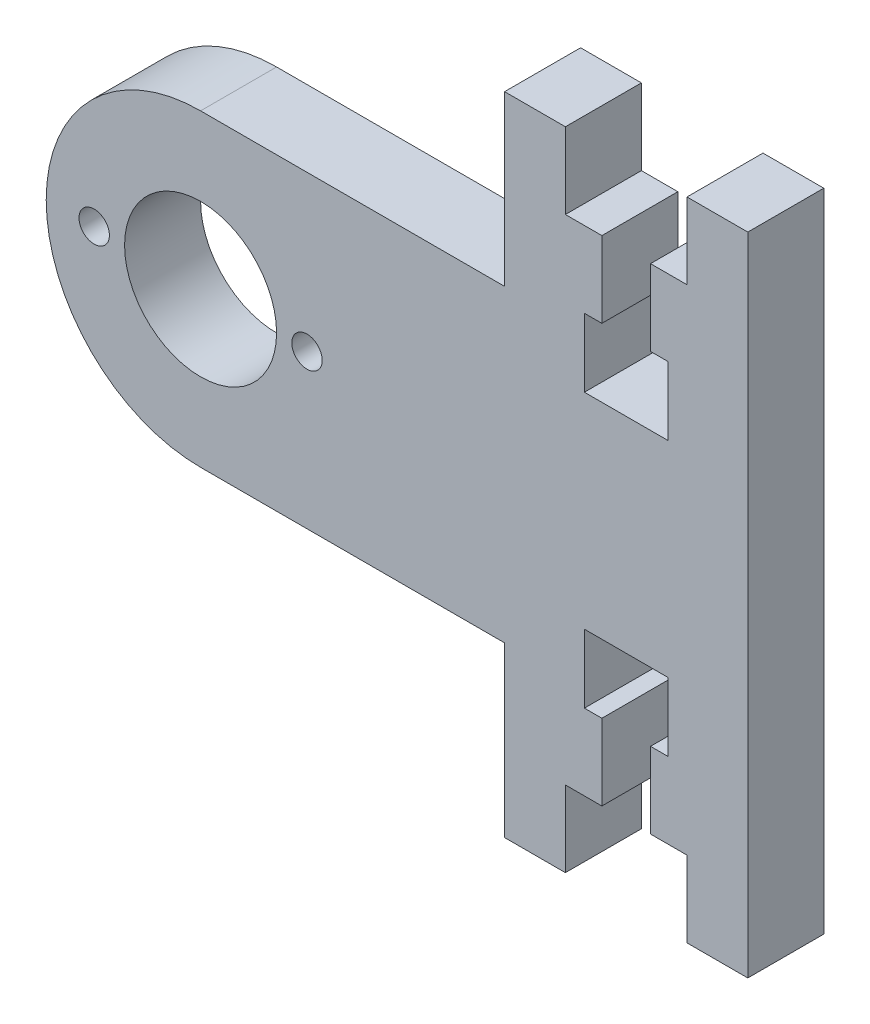
ISO-10303-21;
HEADER;
FILE_DESCRIPTION(('STEP AP214'),'2;1');
FILE_NAME('part.step','',(''),(''),'','','');
FILE_SCHEMA(('AUTOMOTIVE_DESIGN { 1 0 10303 214 1 1 1 1 }'));
ENDSEC;
DATA;
#1=APPLICATION_CONTEXT('core data for automotive mechanical design processes');
#2=APPLICATION_PROTOCOL_DEFINITION('international standard','automotive_design',2000,#1);
#3=PRODUCT_CONTEXT('',#1,'mechanical');
#4=PRODUCT('Part','Part','',(#3));
#5=PRODUCT_RELATED_PRODUCT_CATEGORY('part','',(#4));
#6=PRODUCT_DEFINITION_FORMATION('','',#4);
#7=PRODUCT_DEFINITION_CONTEXT('part definition',#1,'design');
#8=PRODUCT_DEFINITION('design','',#6,#7);
#9=PRODUCT_DEFINITION_SHAPE('','',#8);
#10=(LENGTH_UNIT() NAMED_UNIT(*) SI_UNIT(.MILLI.,.METRE.));
#11=(NAMED_UNIT(*) PLANE_ANGLE_UNIT() SI_UNIT($,.RADIAN.));
#12=(NAMED_UNIT(*) SI_UNIT($,.STERADIAN.) SOLID_ANGLE_UNIT());
#13=UNCERTAINTY_MEASURE_WITH_UNIT(LENGTH_MEASURE(1.E-05),#10,'distance_accuracy_value','');
#14=(GEOMETRIC_REPRESENTATION_CONTEXT(3) GLOBAL_UNCERTAINTY_ASSIGNED_CONTEXT((#13)) GLOBAL_UNIT_ASSIGNED_CONTEXT((#10,
#11,#12)) REPRESENTATION_CONTEXT('',''));
#15=CARTESIAN_POINT('',(0.,0.,0.));
#16=DIRECTION('',(0.,0.,1.));
#17=DIRECTION('',(1.,0.,0.));
#18=AXIS2_PLACEMENT_3D('',#15,#16,#17);
#19=CARTESIAN_POINT('',(0.,5.,5.));
#20=DIRECTION('',(0.,-1.,0.));
#21=DIRECTION('',(0.,0.,-1.));
#22=AXIS2_PLACEMENT_3D('',#19,#20,#21);
#23=PLANE('',#22);
#24=DIRECTION('',(0.,0.,1.));
#25=VECTOR('',#24,1.);
#26=CARTESIAN_POINT('',(-9.6,5.,-5.));
#27=LINE('',#26,#25);
#28=CARTESIAN_POINT('',(-9.6,5.,0.));
#29=VERTEX_POINT('',#28);
#30=CARTESIAN_POINT('',(-9.6,5.,5.));
#31=VERTEX_POINT('',#30);
#32=EDGE_CURVE('E323',#29,#31,#27,.T.);
#33=ORIENTED_EDGE('',*,*,#32,.T.);
#34=DIRECTION('',(-1.,0.,0.));
#35=VECTOR('',#34,1.);
#36=CARTESIAN_POINT('',(0.,5.,5.));
#37=LINE('',#36,#35);
#38=CARTESIAN_POINT('',(-12.,5.,5.));
#39=VERTEX_POINT('',#38);
#40=EDGE_CURVE('E396',#31,#39,#37,.T.);
#41=ORIENTED_EDGE('',*,*,#40,.T.);
#42=DIRECTION('',(0.,0.,1.));
#43=VECTOR('',#42,1.);
#44=CARTESIAN_POINT('',(-12.,5.,-5.));
#45=LINE('',#44,#43);
#46=CARTESIAN_POINT('',(-12.,5.,0.));
#47=VERTEX_POINT('',#46);
#48=EDGE_CURVE('E295',#47,#39,#45,.T.);
#49=ORIENTED_EDGE('',*,*,#48,.F.);
#50=DIRECTION('',(-1.,0.,0.));
#51=VECTOR('',#50,1.);
#52=CARTESIAN_POINT('',(0.,5.,0.));
#53=LINE('',#52,#51);
#54=EDGE_CURVE('E391',#29,#47,#53,.T.);
#55=ORIENTED_EDGE('',*,*,#54,.F.);
#56=EDGE_LOOP('',(#33,#41,#49,#55));
#57=FACE_BOUND('',#56,.T.);
#58=ADVANCED_FACE('F36',(#57),#23,.T.);
#59=CARTESIAN_POINT('',(-3.24547534604185E-13,37.5,5.));
#60=DIRECTION('',(0.,-1.,0.));
#61=DIRECTION('',(1.,0.,0.));
#62=AXIS2_PLACEMENT_3D('',#59,#60,#61);
#63=PLANE('',#62);
#64=DIRECTION('',(-1.,0.,0.));
#65=VECTOR('',#64,1.);
#66=CARTESIAN_POINT('',(-3.24547534604185E-13,37.5,5.));
#67=LINE('',#66,#65);
#68=CARTESIAN_POINT('',(-9.59999999999999,37.5,5.));
#69=VERTEX_POINT('',#68);
#70=CARTESIAN_POINT('',(-12.,37.5,5.));
#71=VERTEX_POINT('',#70);
#72=EDGE_CURVE('E260',#69,#71,#67,.T.);
#73=ORIENTED_EDGE('',*,*,#72,.F.);
#74=DIRECTION('',(0.,0.,1.));
#75=VECTOR('',#74,1.);
#76=CARTESIAN_POINT('',(-9.59999999999999,37.5,-5.));
#77=LINE('',#76,#75);
#78=CARTESIAN_POINT('',(-9.59999999999999,37.5,0.));
#79=VERTEX_POINT('',#78);
#80=EDGE_CURVE('E362',#79,#69,#77,.T.);
#81=ORIENTED_EDGE('',*,*,#80,.F.);
#82=DIRECTION('',(-1.,0.,0.));
#83=VECTOR('',#82,1.);
#84=CARTESIAN_POINT('',(-3.24547534604185E-13,37.5,0.));
#85=LINE('',#84,#83);
#86=CARTESIAN_POINT('',(-12.,37.5,0.));
#87=VERTEX_POINT('',#86);
#88=EDGE_CURVE('E59',#79,#87,#85,.T.);
#89=ORIENTED_EDGE('',*,*,#88,.T.);
#90=DIRECTION('',(0.,0.,1.));
#91=VECTOR('',#90,1.);
#92=CARTESIAN_POINT('',(-12.,37.5,-5.));
#93=LINE('',#92,#91);
#94=EDGE_CURVE('E284',#87,#71,#93,.T.);
#95=ORIENTED_EDGE('',*,*,#94,.T.);
#96=EDGE_LOOP('',(#73,#81,#89,#95));
#97=FACE_BOUND('',#96,.T.);
#98=ADVANCED_FACE('F531',(#97),#63,.F.);
#99=DIRECTION('',(0.,0.,1.));
#100=VECTOR('',#99,1.);
#101=CARTESIAN_POINT('',(-6.4,5.,-5.));
#102=LINE('',#101,#100);
#103=CARTESIAN_POINT('',(-6.4,5.,0.));
#104=VERTEX_POINT('',#103);
#105=CARTESIAN_POINT('',(-6.4,5.,5.));
#106=VERTEX_POINT('',#105);
#107=EDGE_CURVE('E337',#104,#106,#102,.T.);
#108=ORIENTED_EDGE('',*,*,#107,.F.);
#109=CARTESIAN_POINT('',(-4.,5.,0.));
#110=VERTEX_POINT('',#109);
#111=EDGE_CURVE('E51',#110,#104,#53,.T.);
#112=ORIENTED_EDGE('',*,*,#111,.F.);
#113=DIRECTION('',(0.,0.,1.));
#114=VECTOR('',#113,1.);
#115=CARTESIAN_POINT('',(-4.,5.,-5.));
#116=LINE('',#115,#114);
#117=CARTESIAN_POINT('',(-4.,5.,5.));
#118=VERTEX_POINT('',#117);
#119=EDGE_CURVE('E285',#110,#118,#116,.T.);
#120=ORIENTED_EDGE('',*,*,#119,.T.);
#121=EDGE_CURVE('E392',#118,#106,#37,.T.);
#122=ORIENTED_EDGE('',*,*,#121,.T.);
#123=EDGE_LOOP('',(#108,#112,#120,#122));
#124=FACE_BOUND('',#123,.T.);
#125=ADVANCED_FACE('F38',(#124),#23,.T.);
#126=CARTESIAN_POINT('',(0.,0.,5.));
#127=DIRECTION('',(0.,1.,0.));
#128=DIRECTION('',(-1.,0.,0.));
#129=AXIS2_PLACEMENT_3D('',#126,#127,#128);
#130=PLANE('',#129);
#131=DIRECTION('',(1.,0.,0.));
#132=VECTOR('',#131,1.);
#133=CARTESIAN_POINT('',(0.,0.,5.));
#134=LINE('',#133,#132);
#135=CARTESIAN_POINT('',(-4.,0.,5.));
#136=VERTEX_POINT('',#135);
#137=CARTESIAN_POINT('',(0.,0.,5.));
#138=VERTEX_POINT('',#137);
#139=EDGE_CURVE('E395',#136,#138,#134,.T.);
#140=ORIENTED_EDGE('',*,*,#139,.F.);
#141=DIRECTION('',(0.,0.,1.));
#142=VECTOR('',#141,1.);
#143=CARTESIAN_POINT('',(-4.,0.,-5.));
#144=LINE('',#143,#142);
#145=CARTESIAN_POINT('',(-4.,0.,0.));
#146=VERTEX_POINT('',#145);
#147=EDGE_CURVE('E283',#146,#136,#144,.T.);
#148=ORIENTED_EDGE('',*,*,#147,.F.);
#149=DIRECTION('',(1.,0.,0.));
#150=VECTOR('',#149,1.);
#151=CARTESIAN_POINT('',(0.,0.,0.));
#152=LINE('',#151,#150);
#153=CARTESIAN_POINT('',(0.,0.,0.));
#154=VERTEX_POINT('',#153);
#155=EDGE_CURVE('E420',#146,#154,#152,.T.);
#156=ORIENTED_EDGE('',*,*,#155,.T.);
#157=DIRECTION('',(0.,0.,-1.));
#158=VECTOR('',#157,1.);
#159=CARTESIAN_POINT('',(0.,0.,5.));
#160=LINE('',#159,#158);
#161=EDGE_CURVE('E464',#138,#154,#160,.T.);
#162=ORIENTED_EDGE('',*,*,#161,.F.);
#163=EDGE_LOOP('',(#140,#148,#156,#162));
#164=FACE_BOUND('',#163,.T.);
#165=ADVANCED_FACE('F538',(#164),#130,.F.);
#166=CARTESIAN_POINT('',(0.,0.,5.));
#167=DIRECTION('',(-1.,0.,0.));
#168=DIRECTION('',(0.,0.,1.));
#169=AXIS2_PLACEMENT_3D('',#166,#167,#168);
#170=PLANE('',#169);
#171=DIRECTION('',(0.,1.,0.));
#172=VECTOR('',#171,1.);
#173=CARTESIAN_POINT('',(0.,0.,0.));
#174=LINE('',#173,#172);
#175=CARTESIAN_POINT('',(0.,42.5,0.));
#176=VERTEX_POINT('',#175);
#177=EDGE_CURVE('E422',#154,#176,#174,.T.);
#178=ORIENTED_EDGE('',*,*,#177,.T.);
#179=DIRECTION('',(0.,0.,-1.));
#180=VECTOR('',#179,1.);
#181=CARTESIAN_POINT('',(0.,42.5,5.));
#182=LINE('',#181,#180);
#183=CARTESIAN_POINT('',(0.,42.5,5.));
#184=VERTEX_POINT('',#183);
#185=EDGE_CURVE('E461',#184,#176,#182,.T.);
#186=ORIENTED_EDGE('',*,*,#185,.F.);
#187=DIRECTION('',(0.,1.,0.));
#188=VECTOR('',#187,1.);
#189=CARTESIAN_POINT('',(0.,0.,5.));
#190=LINE('',#189,#188);
#191=EDGE_CURVE('E398',#138,#184,#190,.T.);
#192=ORIENTED_EDGE('',*,*,#191,.F.);
#193=ORIENTED_EDGE('',*,*,#161,.T.);
#194=EDGE_LOOP('',(#178,#186,#192,#193));
#195=FACE_BOUND('',#194,.T.);
#196=ADVANCED_FACE('F549',(#195),#170,.F.);
#197=CARTESIAN_POINT('',(0.,42.5,5.));
#198=DIRECTION('',(0.,-1.,0.));
#199=DIRECTION('',(1.,0.,0.));
#200=AXIS2_PLACEMENT_3D('',#197,#198,#199);
#201=PLANE('',#200);
#202=DIRECTION('',(-1.,0.,0.));
#203=VECTOR('',#202,1.);
#204=CARTESIAN_POINT('',(0.,42.5,0.));
#205=LINE('',#204,#203);
#206=CARTESIAN_POINT('',(-4.,42.5,0.));
#207=VERTEX_POINT('',#206);
#208=EDGE_CURVE('E424',#176,#207,#205,.T.);
#209=ORIENTED_EDGE('',*,*,#208,.T.);
#210=DIRECTION('',(0.,0.,1.));
#211=VECTOR('',#210,1.);
#212=CARTESIAN_POINT('',(-4.,42.5,-5.));
#213=LINE('',#212,#211);
#214=CARTESIAN_POINT('',(-4.,42.5,5.));
#215=VERTEX_POINT('',#214);
#216=EDGE_CURVE('E269',#207,#215,#213,.T.);
#217=ORIENTED_EDGE('',*,*,#216,.T.);
#218=DIRECTION('',(-1.,0.,0.));
#219=VECTOR('',#218,1.);
#220=CARTESIAN_POINT('',(0.,42.5,5.));
#221=LINE('',#220,#219);
#222=EDGE_CURVE('E275',#184,#215,#221,.T.);
#223=ORIENTED_EDGE('',*,*,#222,.F.);
#224=ORIENTED_EDGE('',*,*,#185,.T.);
#225=EDGE_LOOP('',(#209,#217,#223,#224));
#226=FACE_BOUND('',#225,.T.);
#227=ADVANCED_FACE('F543',(#226),#201,.F.);
#228=CARTESIAN_POINT('',(-4.,37.5,0.));
#229=VERTEX_POINT('',#228);
#230=CARTESIAN_POINT('',(-6.39999999999999,37.5,0.));
#231=VERTEX_POINT('',#230);
#232=EDGE_CURVE('E427',#229,#231,#85,.T.);
#233=ORIENTED_EDGE('',*,*,#232,.T.);
#234=DIRECTION('',(0.,0.,1.));
#235=VECTOR('',#234,1.);
#236=CARTESIAN_POINT('',(-6.39999999999999,37.5,-5.));
#237=LINE('',#236,#235);
#238=CARTESIAN_POINT('',(-6.39999999999999,37.5,5.));
#239=VERTEX_POINT('',#238);
#240=EDGE_CURVE('E255',#231,#239,#237,.T.);
#241=ORIENTED_EDGE('',*,*,#240,.T.);
#242=CARTESIAN_POINT('',(-4.,37.5,5.));
#243=VERTEX_POINT('',#242);
#244=EDGE_CURVE('E250',#243,#239,#67,.T.);
#245=ORIENTED_EDGE('',*,*,#244,.F.);
#246=DIRECTION('',(0.,0.,1.));
#247=VECTOR('',#246,1.);
#248=CARTESIAN_POINT('',(-4.,37.5,-5.));
#249=LINE('',#248,#247);
#250=EDGE_CURVE('E254',#229,#243,#249,.T.);
#251=ORIENTED_EDGE('',*,*,#250,.F.);
#252=EDGE_LOOP('',(#233,#241,#245,#251));
#253=FACE_BOUND('',#252,.T.);
#254=ADVANCED_FACE('F253',(#253),#63,.F.);
#255=CARTESIAN_POINT('',(0.,42.5,5.));
#256=DIRECTION('',(0.,1.,0.));
#257=DIRECTION('',(0.,0.,1.));
#258=AXIS2_PLACEMENT_3D('',#255,#256,#257);
#259=PLANE('',#258);
#260=DIRECTION('',(0.,0.,1.));
#261=VECTOR('',#260,1.);
#262=CARTESIAN_POINT('',(-12.,42.5,-5.));
#263=LINE('',#262,#261);
#264=CARTESIAN_POINT('',(-12.,42.5,0.));
#265=VERTEX_POINT('',#264);
#266=CARTESIAN_POINT('',(-12.,42.5,5.));
#267=VERTEX_POINT('',#266);
#268=EDGE_CURVE('E291',#265,#267,#263,.T.);
#269=ORIENTED_EDGE('',*,*,#268,.F.);
#270=DIRECTION('',(1.,0.,0.));
#271=VECTOR('',#270,1.);
#272=CARTESIAN_POINT('',(0.,42.5,0.));
#273=LINE('',#272,#271);
#274=CARTESIAN_POINT('',(-16.,42.5,0.));
#275=VERTEX_POINT('',#274);
#276=EDGE_CURVE('E429',#275,#265,#273,.T.);
#277=ORIENTED_EDGE('',*,*,#276,.F.);
#278=DIRECTION('',(0.,0.,-1.));
#279=VECTOR('',#278,1.);
#280=CARTESIAN_POINT('',(-16.,42.5,5.));
#281=LINE('',#280,#279);
#282=CARTESIAN_POINT('',(-16.,42.5,5.));
#283=VERTEX_POINT('',#282);
#284=EDGE_CURVE('E459',#283,#275,#281,.T.);
#285=ORIENTED_EDGE('',*,*,#284,.F.);
#286=DIRECTION('',(1.,0.,0.));
#287=VECTOR('',#286,1.);
#288=CARTESIAN_POINT('',(0.,42.5,5.));
#289=LINE('',#288,#287);
#290=EDGE_CURVE('E259',#283,#267,#289,.T.);
#291=ORIENTED_EDGE('',*,*,#290,.T.);
#292=EDGE_LOOP('',(#269,#277,#285,#291));
#293=FACE_BOUND('',#292,.T.);
#294=ADVANCED_FACE('F523',(#293),#259,.T.);
#295=CARTESIAN_POINT('',(-16.,0.,5.));
#296=DIRECTION('',(1.,0.,0.));
#297=DIRECTION('',(0.,0.,-1.));
#298=AXIS2_PLACEMENT_3D('',#295,#296,#297);
#299=PLANE('',#298);
#300=DIRECTION('',(0.,-1.,0.));
#301=VECTOR('',#300,1.);
#302=CARTESIAN_POINT('',(-16.,0.,0.));
#303=LINE('',#302,#301);
#304=CARTESIAN_POINT('',(-16.,31.40625,0.));
#305=VERTEX_POINT('',#304);
#306=EDGE_CURVE('E432',#275,#305,#303,.T.);
#307=ORIENTED_EDGE('',*,*,#306,.T.);
#308=DIRECTION('',(0.,0.,-1.));
#309=VECTOR('',#308,1.);
#310=CARTESIAN_POINT('',(-16.,31.40625,5.));
#311=LINE('',#310,#309);
#312=CARTESIAN_POINT('',(-16.,31.40625,5.));
#313=VERTEX_POINT('',#312);
#314=EDGE_CURVE('E457',#313,#305,#311,.T.);
#315=ORIENTED_EDGE('',*,*,#314,.F.);
#316=DIRECTION('',(0.,-1.,0.));
#317=VECTOR('',#316,1.);
#318=CARTESIAN_POINT('',(-16.,0.,5.));
#319=LINE('',#318,#317);
#320=EDGE_CURVE('E403',#283,#313,#319,.T.);
#321=ORIENTED_EDGE('',*,*,#320,.F.);
#322=ORIENTED_EDGE('',*,*,#284,.T.);
#323=EDGE_LOOP('',(#307,#315,#321,#322));
#324=FACE_BOUND('',#323,.T.);
#325=ADVANCED_FACE('F548',(#324),#299,.F.);
#326=CARTESIAN_POINT('',(0.,31.40625,5.));
#327=DIRECTION('',(0.,1.,0.));
#328=DIRECTION('',(-1.,0.,0.));
#329=AXIS2_PLACEMENT_3D('',#326,#327,#328);
#330=PLANE('',#329);
#331=DIRECTION('',(1.,0.,0.));
#332=VECTOR('',#331,1.);
#333=CARTESIAN_POINT('',(0.,31.40625,0.));
#334=LINE('',#333,#332);
#335=CARTESIAN_POINT('',(-36.,31.40625,0.));
#336=VERTEX_POINT('',#335);
#337=EDGE_CURVE('E435',#336,#305,#334,.T.);
#338=ORIENTED_EDGE('',*,*,#337,.F.);
#339=DIRECTION('',(0.,0.,-1.));
#340=VECTOR('',#339,1.);
#341=CARTESIAN_POINT('',(-36.,31.40625,5.));
#342=LINE('',#341,#340);
#343=CARTESIAN_POINT('',(-36.,31.40625,5.));
#344=VERTEX_POINT('',#343);
#345=EDGE_CURVE('E455',#344,#336,#342,.T.);
#346=ORIENTED_EDGE('',*,*,#345,.F.);
#347=DIRECTION('',(1.,0.,0.));
#348=VECTOR('',#347,1.);
#349=CARTESIAN_POINT('',(0.,31.40625,5.));
#350=LINE('',#349,#348);
#351=EDGE_CURVE('E405',#344,#313,#350,.T.);
#352=ORIENTED_EDGE('',*,*,#351,.T.);
#353=ORIENTED_EDGE('',*,*,#314,.T.);
#354=EDGE_LOOP('',(#338,#346,#352,#353));
#355=FACE_BOUND('',#354,.T.);
#356=ADVANCED_FACE('F647',(#355),#330,.T.);
#357=CARTESIAN_POINT('',(-36.,21.25,5.));
#358=DIRECTION('',(0.,0.,-1.));
#359=DIRECTION('',(-1.,0.,0.));
#360=AXIS2_PLACEMENT_3D('',#357,#358,#359);
#361=CYLINDRICAL_SURFACE('',#360,10.15625);
#362=CARTESIAN_POINT('',(-36.,21.25,0.));
#363=DIRECTION('',(0.,0.,1.));
#364=DIRECTION('',(1.,0.,0.));
#365=AXIS2_PLACEMENT_3D('',#362,#363,#364);
#366=CIRCLE('',#365,10.15625);
#367=CARTESIAN_POINT('',(-36.,11.09375,0.));
#368=VERTEX_POINT('',#367);
#369=EDGE_CURVE('E438',#336,#368,#366,.T.);
#370=ORIENTED_EDGE('',*,*,#369,.T.);
#371=DIRECTION('',(0.,0.,-1.));
#372=VECTOR('',#371,1.);
#373=CARTESIAN_POINT('',(-36.,11.09375,5.));
#374=LINE('',#373,#372);
#375=CARTESIAN_POINT('',(-36.,11.09375,5.));
#376=VERTEX_POINT('',#375);
#377=EDGE_CURVE('E453',#376,#368,#374,.T.);
#378=ORIENTED_EDGE('',*,*,#377,.F.);
#379=CARTESIAN_POINT('',(-36.,21.25,5.));
#380=DIRECTION('',(0.,0.,1.));
#381=DIRECTION('',(1.,0.,0.));
#382=AXIS2_PLACEMENT_3D('',#379,#380,#381);
#383=CIRCLE('',#382,10.15625);
#384=EDGE_CURVE('E408',#344,#376,#383,.T.);
#385=ORIENTED_EDGE('',*,*,#384,.F.);
#386=ORIENTED_EDGE('',*,*,#345,.T.);
#387=EDGE_LOOP('',(#370,#378,#385,#386));
#388=FACE_BOUND('',#387,.T.);
#389=ADVANCED_FACE('F643',(#388),#361,.T.);
#390=CARTESIAN_POINT('',(0.,11.09375,5.));
#391=DIRECTION('',(0.,-1.,0.));
#392=DIRECTION('',(1.,0.,0.));
#393=AXIS2_PLACEMENT_3D('',#390,#391,#392);
#394=PLANE('',#393);
#395=DIRECTION('',(-1.,0.,0.));
#396=VECTOR('',#395,1.);
#397=CARTESIAN_POINT('',(0.,11.09375,0.));
#398=LINE('',#397,#396);
#399=CARTESIAN_POINT('',(-16.,11.09375,0.));
#400=VERTEX_POINT('',#399);
#401=EDGE_CURVE('E441',#400,#368,#398,.T.);
#402=ORIENTED_EDGE('',*,*,#401,.F.);
#403=DIRECTION('',(0.,0.,-1.));
#404=VECTOR('',#403,1.);
#405=CARTESIAN_POINT('',(-16.,11.09375,5.));
#406=LINE('',#405,#404);
#407=CARTESIAN_POINT('',(-16.,11.09375,5.));
#408=VERTEX_POINT('',#407);
#409=EDGE_CURVE('E451',#408,#400,#406,.T.);
#410=ORIENTED_EDGE('',*,*,#409,.F.);
#411=DIRECTION('',(-1.,0.,0.));
#412=VECTOR('',#411,1.);
#413=CARTESIAN_POINT('',(0.,11.09375,5.));
#414=LINE('',#413,#412);
#415=EDGE_CURVE('E410',#408,#376,#414,.T.);
#416=ORIENTED_EDGE('',*,*,#415,.T.);
#417=ORIENTED_EDGE('',*,*,#377,.T.);
#418=EDGE_LOOP('',(#402,#410,#416,#417));
#419=FACE_BOUND('',#418,.T.);
#420=ADVANCED_FACE('F639',(#419),#394,.T.);
#421=CARTESIAN_POINT('',(-16.,0.,5.));
#422=DIRECTION('',(-1.,0.,0.));
#423=DIRECTION('',(0.,0.,1.));
#424=AXIS2_PLACEMENT_3D('',#421,#422,#423);
#425=PLANE('',#424);
#426=DIRECTION('',(0.,1.,0.));
#427=VECTOR('',#426,1.);
#428=CARTESIAN_POINT('',(-16.,0.,0.));
#429=LINE('',#428,#427);
#430=CARTESIAN_POINT('',(-16.,0.,0.));
#431=VERTEX_POINT('',#430);
#432=EDGE_CURVE('E444',#431,#400,#429,.T.);
#433=ORIENTED_EDGE('',*,*,#432,.F.);
#434=DIRECTION('',(0.,0.,-1.));
#435=VECTOR('',#434,1.);
#436=CARTESIAN_POINT('',(-16.,0.,5.));
#437=LINE('',#436,#435);
#438=CARTESIAN_POINT('',(-16.,0.,5.));
#439=VERTEX_POINT('',#438);
#440=EDGE_CURVE('E418',#439,#431,#437,.T.);
#441=ORIENTED_EDGE('',*,*,#440,.F.);
#442=DIRECTION('',(0.,1.,0.));
#443=VECTOR('',#442,1.);
#444=CARTESIAN_POINT('',(-16.,0.,5.));
#445=LINE('',#444,#443);
#446=EDGE_CURVE('E413',#439,#408,#445,.T.);
#447=ORIENTED_EDGE('',*,*,#446,.T.);
#448=ORIENTED_EDGE('',*,*,#409,.T.);
#449=EDGE_LOOP('',(#433,#441,#447,#448));
#450=FACE_BOUND('',#449,.T.);
#451=ADVANCED_FACE('F635',(#450),#425,.T.);
#452=CARTESIAN_POINT('',(0.,0.,5.));
#453=DIRECTION('',(0.,-1.,0.));
#454=DIRECTION('',(1.,0.,0.));
#455=AXIS2_PLACEMENT_3D('',#452,#453,#454);
#456=PLANE('',#455);
#457=DIRECTION('',(0.,0.,1.));
#458=VECTOR('',#457,1.);
#459=CARTESIAN_POINT('',(-12.,0.,-5.));
#460=LINE('',#459,#458);
#461=CARTESIAN_POINT('',(-12.,0.,0.));
#462=VERTEX_POINT('',#461);
#463=CARTESIAN_POINT('',(-12.,0.,5.));
#464=VERTEX_POINT('',#463);
#465=EDGE_CURVE('E296',#462,#464,#460,.T.);
#466=ORIENTED_EDGE('',*,*,#465,.T.);
#467=DIRECTION('',(-1.,0.,0.));
#468=VECTOR('',#467,1.);
#469=CARTESIAN_POINT('',(0.,0.,5.));
#470=LINE('',#469,#468);
#471=EDGE_CURVE('E416',#464,#439,#470,.T.);
#472=ORIENTED_EDGE('',*,*,#471,.T.);
#473=ORIENTED_EDGE('',*,*,#440,.T.);
#474=DIRECTION('',(-1.,0.,0.));
#475=VECTOR('',#474,1.);
#476=CARTESIAN_POINT('',(0.,0.,0.));
#477=LINE('',#476,#475);
#478=EDGE_CURVE('E447',#462,#431,#477,.T.);
#479=ORIENTED_EDGE('',*,*,#478,.F.);
#480=EDGE_LOOP('',(#466,#472,#473,#479));
#481=FACE_BOUND('',#480,.T.);
#482=ADVANCED_FACE('F630',(#481),#456,.T.);
#483=CARTESIAN_POINT('',(0.,0.,5.));
#484=DIRECTION('',(0.,0.,1.));
#485=DIRECTION('',(1.,0.,0.));
#486=AXIS2_PLACEMENT_3D('',#483,#484,#485);
#487=PLANE('',#486);
#488=ORIENTED_EDGE('',*,*,#121,.F.);
#489=DIRECTION('',(0.,1.,0.));
#490=VECTOR('',#489,1.);
#491=CARTESIAN_POINT('',(-4.,5.,5.));
#492=LINE('',#491,#490);
#493=EDGE_CURVE('E280',#136,#118,#492,.T.);
#494=ORIENTED_EDGE('',*,*,#493,.F.);
#495=ORIENTED_EDGE('',*,*,#139,.T.);
#496=ORIENTED_EDGE('',*,*,#191,.T.);
#497=ORIENTED_EDGE('',*,*,#222,.T.);
#498=DIRECTION('',(0.,1.,0.));
#499=VECTOR('',#498,1.);
#500=CARTESIAN_POINT('',(-4.,37.5,5.));
#501=LINE('',#500,#499);
#502=EDGE_CURVE('E265',#243,#215,#501,.T.);
#503=ORIENTED_EDGE('',*,*,#502,.F.);
#504=ORIENTED_EDGE('',*,*,#244,.T.);
#505=DIRECTION('',(0.,1.,0.));
#506=VECTOR('',#505,1.);
#507=CARTESIAN_POINT('',(-6.39999999999999,37.5,5.));
#508=LINE('',#507,#506);
#509=CARTESIAN_POINT('',(-6.39999999999999,32.5,5.));
#510=VERTEX_POINT('',#509);
#511=EDGE_CURVE('E355',#510,#239,#508,.T.);
#512=ORIENTED_EDGE('',*,*,#511,.F.);
#513=DIRECTION('',(-1.,0.,0.));
#514=VECTOR('',#513,1.);
#515=CARTESIAN_POINT('',(-5.24999999999999,32.5,5.));
#516=LINE('',#515,#514);
#517=CARTESIAN_POINT('',(-5.24999999999999,32.5,5.));
#518=VERTEX_POINT('',#517);
#519=EDGE_CURVE('E352',#518,#510,#516,.T.);
#520=ORIENTED_EDGE('',*,*,#519,.F.);
#521=DIRECTION('',(0.,1.,0.));
#522=VECTOR('',#521,1.);
#523=CARTESIAN_POINT('',(-5.24999999999999,32.5,5.));
#524=LINE('',#523,#522);
#525=CARTESIAN_POINT('',(-5.24999999999999,28.,5.));
#526=VERTEX_POINT('',#525);
#527=EDGE_CURVE('E349',#526,#518,#524,.T.);
#528=ORIENTED_EDGE('',*,*,#527,.F.);
#529=DIRECTION('',(1.,0.,0.));
#530=VECTOR('',#529,1.);
#531=CARTESIAN_POINT('',(-5.24999999999999,28.,5.));
#532=LINE('',#531,#530);
#533=CARTESIAN_POINT('',(-10.75,28.,5.));
#534=VERTEX_POINT('',#533);
#535=EDGE_CURVE('E346',#534,#526,#532,.T.);
#536=ORIENTED_EDGE('',*,*,#535,.F.);
#537=DIRECTION('',(0.,-1.,0.));
#538=VECTOR('',#537,1.);
#539=CARTESIAN_POINT('',(-10.75,32.5,5.));
#540=LINE('',#539,#538);
#541=CARTESIAN_POINT('',(-10.75,32.5,5.));
#542=VERTEX_POINT('',#541);
#543=EDGE_CURVE('E343',#542,#534,#540,.T.);
#544=ORIENTED_EDGE('',*,*,#543,.F.);
#545=DIRECTION('',(-1.,0.,0.));
#546=VECTOR('',#545,1.);
#547=CARTESIAN_POINT('',(-9.59999999999999,32.5,5.));
#548=LINE('',#547,#546);
#549=CARTESIAN_POINT('',(-9.59999999999999,32.5,5.));
#550=VERTEX_POINT('',#549);
#551=EDGE_CURVE('E299',#550,#542,#548,.T.);
#552=ORIENTED_EDGE('',*,*,#551,.F.);
#553=DIRECTION('',(0.,-1.,0.));
#554=VECTOR('',#553,1.);
#555=CARTESIAN_POINT('',(-9.59999999999999,37.5,5.));
#556=LINE('',#555,#554);
#557=EDGE_CURVE('E357',#69,#550,#556,.T.);
#558=ORIENTED_EDGE('',*,*,#557,.F.);
#559=ORIENTED_EDGE('',*,*,#72,.T.);
#560=DIRECTION('',(0.,-1.,0.));
#561=VECTOR('',#560,1.);
#562=CARTESIAN_POINT('',(-12.,37.5,5.));
#563=LINE('',#562,#561);
#564=EDGE_CURVE('E278',#267,#71,#563,.T.);
#565=ORIENTED_EDGE('',*,*,#564,.F.);
#566=ORIENTED_EDGE('',*,*,#290,.F.);
#567=ORIENTED_EDGE('',*,*,#320,.T.);
#568=ORIENTED_EDGE('',*,*,#351,.F.);
#569=ORIENTED_EDGE('',*,*,#384,.T.);
#570=ORIENTED_EDGE('',*,*,#415,.F.);
#571=ORIENTED_EDGE('',*,*,#446,.F.);
#572=ORIENTED_EDGE('',*,*,#471,.F.);
#573=DIRECTION('',(0.,-1.,0.));
#574=VECTOR('',#573,1.);
#575=CARTESIAN_POINT('',(-12.,5.,5.));
#576=LINE('',#575,#574);
#577=EDGE_CURVE('E287',#39,#464,#576,.T.);
#578=ORIENTED_EDGE('',*,*,#577,.F.);
#579=ORIENTED_EDGE('',*,*,#40,.F.);
#580=DIRECTION('',(0.,-1.,0.));
#581=VECTOR('',#580,1.);
#582=CARTESIAN_POINT('',(-9.6,5.,5.));
#583=LINE('',#582,#581);
#584=CARTESIAN_POINT('',(-9.6,10.,5.));
#585=VERTEX_POINT('',#584);
#586=EDGE_CURVE('E302',#585,#31,#583,.T.);
#587=ORIENTED_EDGE('',*,*,#586,.F.);
#588=DIRECTION('',(1.,0.,0.));
#589=VECTOR('',#588,1.);
#590=CARTESIAN_POINT('',(-9.6,10.,5.));
#591=LINE('',#590,#589);
#592=CARTESIAN_POINT('',(-10.75,10.,5.));
#593=VERTEX_POINT('',#592);
#594=EDGE_CURVE('E320',#593,#585,#591,.T.);
#595=ORIENTED_EDGE('',*,*,#594,.F.);
#596=DIRECTION('',(0.,-1.,0.));
#597=VECTOR('',#596,1.);
#598=CARTESIAN_POINT('',(-10.75,10.,5.));
#599=LINE('',#598,#597);
#600=CARTESIAN_POINT('',(-10.75,14.5,5.));
#601=VERTEX_POINT('',#600);
#602=EDGE_CURVE('E317',#601,#593,#599,.T.);
#603=ORIENTED_EDGE('',*,*,#602,.F.);
#604=DIRECTION('',(-1.,0.,0.));
#605=VECTOR('',#604,1.);
#606=CARTESIAN_POINT('',(-5.25,14.5,5.));
#607=LINE('',#606,#605);
#608=CARTESIAN_POINT('',(-5.25,14.5,5.));
#609=VERTEX_POINT('',#608);
#610=EDGE_CURVE('E314',#609,#601,#607,.T.);
#611=ORIENTED_EDGE('',*,*,#610,.F.);
#612=DIRECTION('',(0.,1.,0.));
#613=VECTOR('',#612,1.);
#614=CARTESIAN_POINT('',(-5.25,10.,5.));
#615=LINE('',#614,#613);
#616=CARTESIAN_POINT('',(-5.25,10.,5.));
#617=VERTEX_POINT('',#616);
#618=EDGE_CURVE('E311',#617,#609,#615,.T.);
#619=ORIENTED_EDGE('',*,*,#618,.F.);
#620=DIRECTION('',(1.,0.,0.));
#621=VECTOR('',#620,1.);
#622=CARTESIAN_POINT('',(-5.25,10.,5.));
#623=LINE('',#622,#621);
#624=CARTESIAN_POINT('',(-6.4,10.,5.));
#625=VERTEX_POINT('',#624);
#626=EDGE_CURVE('E308',#625,#617,#623,.T.);
#627=ORIENTED_EDGE('',*,*,#626,.F.);
#628=DIRECTION('',(0.,1.,0.));
#629=VECTOR('',#628,1.);
#630=CARTESIAN_POINT('',(-6.4,5.,5.));
#631=LINE('',#630,#629);
#632=EDGE_CURVE('E304',#106,#625,#631,.T.);
#633=ORIENTED_EDGE('',*,*,#632,.F.);
#634=EDGE_LOOP('',(#488,#494,#495,#496,#497,#503,#504,#512,#520,#528,#536,#544,#552,#558,#559,
#565,#566,#567,#568,#569,#570,#571,#572,#578,#579,#587,#595,#603,#611,#619,#627,#633));
#635=FACE_BOUND('',#634,.T.);
#636=CARTESIAN_POINT('',(-43.,21.3124545754266,5.));
#637=DIRECTION('',(0.,0.,1.));
#638=DIRECTION('',(1.,0.,0.));
#639=AXIS2_PLACEMENT_3D('',#636,#637,#638);
#640=CIRCLE('',#639,0.999999999999998);
#641=CARTESIAN_POINT('',(-42.,21.3124545754266,5.));
#642=VERTEX_POINT('',#641);
#643=EDGE_CURVE('E388',#642,#642,#640,.T.);
#644=ORIENTED_EDGE('',*,*,#643,.F.);
#645=EDGE_LOOP('',(#644));
#646=FACE_BOUND('',#645,.T.);
#647=CARTESIAN_POINT('',(-29.,21.1875454245734,5.));
#648=DIRECTION('',(0.,0.,1.));
#649=DIRECTION('',(1.,0.,0.));
#650=AXIS2_PLACEMENT_3D('',#647,#648,#649);
#651=CIRCLE('',#650,0.999999999999997);
#652=CARTESIAN_POINT('',(-28.,21.1875454245734,5.));
#653=VERTEX_POINT('',#652);
#654=EDGE_CURVE('E385',#653,#653,#651,.T.);
#655=ORIENTED_EDGE('',*,*,#654,.F.);
#656=EDGE_LOOP('',(#655));
#657=FACE_BOUND('',#656,.T.);
#658=CARTESIAN_POINT('',(-36.,21.25,5.));
#659=DIRECTION('',(0.,0.,1.));
#660=DIRECTION('',(1.,0.,0.));
#661=AXIS2_PLACEMENT_3D('',#658,#659,#660);
#662=CIRCLE('',#661,5.);
#663=CARTESIAN_POINT('',(-31.,21.25,5.));
#664=VERTEX_POINT('',#663);
#665=EDGE_CURVE('E382',#664,#664,#662,.T.);
#666=ORIENTED_EDGE('',*,*,#665,.F.);
#667=EDGE_LOOP('',(#666));
#668=FACE_BOUND('',#667,.T.);
#669=ADVANCED_FACE('F272',(#635,#646,#657,#668),#487,.T.);
#670=CARTESIAN_POINT('',(0.,0.,0.));
#671=DIRECTION('',(0.,0.,1.));
#672=DIRECTION('',(1.,0.,0.));
#673=AXIS2_PLACEMENT_3D('',#670,#671,#672);
#674=PLANE('',#673);
#675=DIRECTION('',(0.,1.,0.));
#676=VECTOR('',#675,1.);
#677=CARTESIAN_POINT('',(-4.,0.,0.));
#678=LINE('',#677,#676);
#679=EDGE_CURVE('E11',#146,#110,#678,.T.);
#680=ORIENTED_EDGE('',*,*,#679,.T.);
#681=ORIENTED_EDGE('',*,*,#111,.T.);
#682=DIRECTION('',(0.,1.,0.));
#683=VECTOR('',#682,1.);
#684=CARTESIAN_POINT('',(-6.4,0.,0.));
#685=LINE('',#684,#683);
#686=CARTESIAN_POINT('',(-6.4,10.,0.));
#687=VERTEX_POINT('',#686);
#688=EDGE_CURVE('E488',#104,#687,#685,.T.);
#689=ORIENTED_EDGE('',*,*,#688,.T.);
#690=DIRECTION('',(1.,0.,0.));
#691=VECTOR('',#690,1.);
#692=CARTESIAN_POINT('',(0.,10.,0.));
#693=LINE('',#692,#691);
#694=CARTESIAN_POINT('',(-5.25,10.,0.));
#695=VERTEX_POINT('',#694);
#696=EDGE_CURVE('E491',#687,#695,#693,.T.);
#697=ORIENTED_EDGE('',*,*,#696,.T.);
#698=DIRECTION('',(0.,1.,0.));
#699=VECTOR('',#698,1.);
#700=CARTESIAN_POINT('',(-5.25,0.,0.));
#701=LINE('',#700,#699);
#702=CARTESIAN_POINT('',(-5.25,14.5,0.));
#703=VERTEX_POINT('',#702);
#704=EDGE_CURVE('E494',#695,#703,#701,.T.);
#705=ORIENTED_EDGE('',*,*,#704,.T.);
#706=DIRECTION('',(-1.,0.,0.));
#707=VECTOR('',#706,1.);
#708=CARTESIAN_POINT('',(0.,14.5,0.));
#709=LINE('',#708,#707);
#710=CARTESIAN_POINT('',(-10.75,14.5,0.));
#711=VERTEX_POINT('',#710);
#712=EDGE_CURVE('E497',#703,#711,#709,.T.);
#713=ORIENTED_EDGE('',*,*,#712,.T.);
#714=DIRECTION('',(0.,-1.,0.));
#715=VECTOR('',#714,1.);
#716=CARTESIAN_POINT('',(-10.75,0.,0.));
#717=LINE('',#716,#715);
#718=CARTESIAN_POINT('',(-10.75,10.,0.));
#719=VERTEX_POINT('',#718);
#720=EDGE_CURVE('E500',#711,#719,#717,.T.);
#721=ORIENTED_EDGE('',*,*,#720,.T.);
#722=DIRECTION('',(1.,0.,0.));
#723=VECTOR('',#722,1.);
#724=CARTESIAN_POINT('',(0.,10.,0.));
#725=LINE('',#724,#723);
#726=CARTESIAN_POINT('',(-9.6,10.,0.));
#727=VERTEX_POINT('',#726);
#728=EDGE_CURVE('E503',#719,#727,#725,.T.);
#729=ORIENTED_EDGE('',*,*,#728,.T.);
#730=DIRECTION('',(0.,-1.,0.));
#731=VECTOR('',#730,1.);
#732=CARTESIAN_POINT('',(-9.6,0.,0.));
#733=LINE('',#732,#731);
#734=EDGE_CURVE('E506',#727,#29,#733,.T.);
#735=ORIENTED_EDGE('',*,*,#734,.T.);
#736=ORIENTED_EDGE('',*,*,#54,.T.);
#737=DIRECTION('',(0.,-1.,0.));
#738=VECTOR('',#737,1.);
#739=CARTESIAN_POINT('',(-12.,0.,0.));
#740=LINE('',#739,#738);
#741=EDGE_CURVE('E509',#47,#462,#740,.T.);
#742=ORIENTED_EDGE('',*,*,#741,.T.);
#743=ORIENTED_EDGE('',*,*,#478,.T.);
#744=ORIENTED_EDGE('',*,*,#432,.T.);
#745=ORIENTED_EDGE('',*,*,#401,.T.);
#746=ORIENTED_EDGE('',*,*,#369,.F.);
#747=ORIENTED_EDGE('',*,*,#337,.T.);
#748=ORIENTED_EDGE('',*,*,#306,.F.);
#749=ORIENTED_EDGE('',*,*,#276,.T.);
#750=DIRECTION('',(0.,-1.,0.));
#751=VECTOR('',#750,1.);
#752=CARTESIAN_POINT('',(-12.,0.,0.));
#753=LINE('',#752,#751);
#754=EDGE_CURVE('E44',#265,#87,#753,.T.);
#755=ORIENTED_EDGE('',*,*,#754,.T.);
#756=ORIENTED_EDGE('',*,*,#88,.F.);
#757=DIRECTION('',(0.,-1.,0.));
#758=VECTOR('',#757,1.);
#759=CARTESIAN_POINT('',(-9.59999999999999,0.,0.));
#760=LINE('',#759,#758);
#761=CARTESIAN_POINT('',(-9.59999999999999,32.5,0.));
#762=VERTEX_POINT('',#761);
#763=EDGE_CURVE('E485',#79,#762,#760,.T.);
#764=ORIENTED_EDGE('',*,*,#763,.T.);
#765=DIRECTION('',(-1.,0.,0.));
#766=VECTOR('',#765,1.);
#767=CARTESIAN_POINT('',(0.,32.5,0.));
#768=LINE('',#767,#766);
#769=CARTESIAN_POINT('',(-10.75,32.5,0.));
#770=VERTEX_POINT('',#769);
#771=EDGE_CURVE('E482',#762,#770,#768,.T.);
#772=ORIENTED_EDGE('',*,*,#771,.T.);
#773=DIRECTION('',(0.,-1.,0.));
#774=VECTOR('',#773,1.);
#775=CARTESIAN_POINT('',(-10.75,0.,0.));
#776=LINE('',#775,#774);
#777=CARTESIAN_POINT('',(-10.75,28.,0.));
#778=VERTEX_POINT('',#777);
#779=EDGE_CURVE('E467',#770,#778,#776,.T.);
#780=ORIENTED_EDGE('',*,*,#779,.T.);
#781=DIRECTION('',(1.,0.,0.));
#782=VECTOR('',#781,1.);
#783=CARTESIAN_POINT('',(0.,28.,0.));
#784=LINE('',#783,#782);
#785=CARTESIAN_POINT('',(-5.24999999999999,28.,0.));
#786=VERTEX_POINT('',#785);
#787=EDGE_CURVE('E470',#778,#786,#784,.T.);
#788=ORIENTED_EDGE('',*,*,#787,.T.);
#789=DIRECTION('',(0.,1.,0.));
#790=VECTOR('',#789,1.);
#791=CARTESIAN_POINT('',(-5.24999999999999,0.,0.));
#792=LINE('',#791,#790);
#793=CARTESIAN_POINT('',(-5.24999999999999,32.5,0.));
#794=VERTEX_POINT('',#793);
#795=EDGE_CURVE('E473',#786,#794,#792,.T.);
#796=ORIENTED_EDGE('',*,*,#795,.T.);
#797=DIRECTION('',(-1.,0.,0.));
#798=VECTOR('',#797,1.);
#799=CARTESIAN_POINT('',(0.,32.5,0.));
#800=LINE('',#799,#798);
#801=CARTESIAN_POINT('',(-6.39999999999999,32.5,0.));
#802=VERTEX_POINT('',#801);
#803=EDGE_CURVE('E476',#794,#802,#800,.T.);
#804=ORIENTED_EDGE('',*,*,#803,.T.);
#805=DIRECTION('',(0.,1.,0.));
#806=VECTOR('',#805,1.);
#807=CARTESIAN_POINT('',(-6.39999999999999,0.,0.));
#808=LINE('',#807,#806);
#809=EDGE_CURVE('E479',#802,#231,#808,.T.);
#810=ORIENTED_EDGE('',*,*,#809,.T.);
#811=ORIENTED_EDGE('',*,*,#232,.F.);
#812=DIRECTION('',(0.,1.,0.));
#813=VECTOR('',#812,1.);
#814=CARTESIAN_POINT('',(-4.,0.,0.));
#815=LINE('',#814,#813);
#816=EDGE_CURVE('E268',#229,#207,#815,.T.);
#817=ORIENTED_EDGE('',*,*,#816,.T.);
#818=ORIENTED_EDGE('',*,*,#208,.F.);
#819=ORIENTED_EDGE('',*,*,#177,.F.);
#820=ORIENTED_EDGE('',*,*,#155,.F.);
#821=EDGE_LOOP('',(#680,#681,#689,#697,#705,#713,#721,#729,#735,#736,#742,#743,#744,#745,#746,
#747,#748,#749,#755,#756,#764,#772,#780,#788,#796,#804,#810,#811,#817,#818,#819,#820));
#822=FACE_BOUND('',#821,.T.);
#823=CARTESIAN_POINT('',(-43.,21.3124545754266,0.));
#824=DIRECTION('',(0.,0.,-1.));
#825=DIRECTION('',(-1.,0.,0.));
#826=AXIS2_PLACEMENT_3D('',#823,#824,#825);
#827=CIRCLE('',#826,0.999999999999998);
#828=CARTESIAN_POINT('',(-44.,21.3124545754266,0.));
#829=VERTEX_POINT('',#828);
#830=EDGE_CURVE('E376',#829,#829,#827,.T.);
#831=ORIENTED_EDGE('',*,*,#830,.F.);
#832=EDGE_LOOP('',(#831));
#833=FACE_BOUND('',#832,.T.);
#834=CARTESIAN_POINT('',(-29.,21.1875454245734,0.));
#835=DIRECTION('',(0.,0.,-1.));
#836=DIRECTION('',(-1.,0.,0.));
#837=AXIS2_PLACEMENT_3D('',#834,#835,#836);
#838=CIRCLE('',#837,0.999999999999997);
#839=CARTESIAN_POINT('',(-30.,21.1875454245734,0.));
#840=VERTEX_POINT('',#839);
#841=EDGE_CURVE('E326',#840,#840,#838,.T.);
#842=ORIENTED_EDGE('',*,*,#841,.F.);
#843=EDGE_LOOP('',(#842));
#844=FACE_BOUND('',#843,.T.);
#845=CARTESIAN_POINT('',(-36.,21.25,0.));
#846=DIRECTION('',(0.,0.,-1.));
#847=DIRECTION('',(-1.,0.,0.));
#848=AXIS2_PLACEMENT_3D('',#845,#846,#847);
#849=CIRCLE('',#848,5.);
#850=CARTESIAN_POINT('',(-41.,21.25,0.));
#851=VERTEX_POINT('',#850);
#852=EDGE_CURVE('E379',#851,#851,#849,.T.);
#853=ORIENTED_EDGE('',*,*,#852,.F.);
#854=EDGE_LOOP('',(#853));
#855=FACE_BOUND('',#854,.T.);
#856=ADVANCED_FACE('F514',(#822,#833,#844,#855),#674,.F.);
#857=CARTESIAN_POINT('',(-36.,21.25,10.));
#858=DIRECTION('',(0.,0.,-1.));
#859=DIRECTION('',(-1.,0.,0.));
#860=AXIS2_PLACEMENT_3D('',#857,#858,#859);
#861=CYLINDRICAL_SURFACE('',#860,5.);
#862=ORIENTED_EDGE('',*,*,#665,.T.);
#863=EDGE_LOOP('',(#862));
#864=FACE_BOUND('',#863,.T.);
#865=ORIENTED_EDGE('',*,*,#852,.T.);
#866=EDGE_LOOP('',(#865));
#867=FACE_BOUND('',#866,.T.);
#868=ADVANCED_FACE('F620',(#864,#867),#861,.F.);
#869=CARTESIAN_POINT('',(-29.,21.1875454245734,10.));
#870=DIRECTION('',(0.,0.,-1.));
#871=DIRECTION('',(-1.,0.,0.));
#872=AXIS2_PLACEMENT_3D('',#869,#870,#871);
#873=CYLINDRICAL_SURFACE('',#872,0.999999999999997);
#874=ORIENTED_EDGE('',*,*,#654,.T.);
#875=EDGE_LOOP('',(#874));
#876=FACE_BOUND('',#875,.T.);
#877=ORIENTED_EDGE('',*,*,#841,.T.);
#878=EDGE_LOOP('',(#877));
#879=FACE_BOUND('',#878,.T.);
#880=ADVANCED_FACE('F617',(#876,#879),#873,.F.);
#881=CARTESIAN_POINT('',(-43.,21.3124545754266,10.));
#882=DIRECTION('',(0.,0.,-1.));
#883=DIRECTION('',(-1.,0.,0.));
#884=AXIS2_PLACEMENT_3D('',#881,#882,#883);
#885=CYLINDRICAL_SURFACE('',#884,0.999999999999998);
#886=ORIENTED_EDGE('',*,*,#643,.T.);
#887=EDGE_LOOP('',(#886));
#888=FACE_BOUND('',#887,.T.);
#889=ORIENTED_EDGE('',*,*,#830,.T.);
#890=EDGE_LOOP('',(#889));
#891=FACE_BOUND('',#890,.T.);
#892=ADVANCED_FACE('F603',(#888,#891),#885,.F.);
#893=CARTESIAN_POINT('',(-9.59999999999999,32.5,-5.));
#894=DIRECTION('',(0.,1.,0.));
#895=DIRECTION('',(0.,0.,1.));
#896=AXIS2_PLACEMENT_3D('',#893,#894,#895);
#897=PLANE('',#896);
#898=DIRECTION('',(0.,0.,1.));
#899=VECTOR('',#898,1.);
#900=CARTESIAN_POINT('',(-9.59999999999999,32.5,-5.));
#901=LINE('',#900,#899);
#902=EDGE_CURVE('E305',#762,#550,#901,.T.);
#903=ORIENTED_EDGE('',*,*,#902,.T.);
#904=ORIENTED_EDGE('',*,*,#551,.T.);
#905=DIRECTION('',(0.,0.,1.));
#906=VECTOR('',#905,1.);
#907=CARTESIAN_POINT('',(-10.75,32.5,-5.));
#908=LINE('',#907,#906);
#909=EDGE_CURVE('E360',#770,#542,#908,.T.);
#910=ORIENTED_EDGE('',*,*,#909,.F.);
#911=ORIENTED_EDGE('',*,*,#771,.F.);
#912=EDGE_LOOP('',(#903,#904,#910,#911));
#913=FACE_BOUND('',#912,.T.);
#914=ADVANCED_FACE('F592',(#913),#897,.F.);
#915=CARTESIAN_POINT('',(-9.59999999999999,37.5,-5.));
#916=DIRECTION('',(-1.,0.,0.));
#917=DIRECTION('',(0.,0.,1.));
#918=AXIS2_PLACEMENT_3D('',#915,#916,#917);
#919=PLANE('',#918);
#920=ORIENTED_EDGE('',*,*,#80,.T.);
#921=ORIENTED_EDGE('',*,*,#557,.T.);
#922=ORIENTED_EDGE('',*,*,#902,.F.);
#923=ORIENTED_EDGE('',*,*,#763,.F.);
#924=EDGE_LOOP('',(#920,#921,#922,#923));
#925=FACE_BOUND('',#924,.T.);
#926=ADVANCED_FACE('F595',(#925),#919,.F.);
#927=CARTESIAN_POINT('',(-6.39999999999999,37.5,-5.));
#928=DIRECTION('',(1.,0.,0.));
#929=DIRECTION('',(0.,0.,-1.));
#930=AXIS2_PLACEMENT_3D('',#927,#928,#929);
#931=PLANE('',#930);
#932=DIRECTION('',(0.,0.,1.));
#933=VECTOR('',#932,1.);
#934=CARTESIAN_POINT('',(-6.39999999999999,32.5,-5.));
#935=LINE('',#934,#933);
#936=EDGE_CURVE('E365',#802,#510,#935,.T.);
#937=ORIENTED_EDGE('',*,*,#936,.T.);
#938=ORIENTED_EDGE('',*,*,#511,.T.);
#939=ORIENTED_EDGE('',*,*,#240,.F.);
#940=ORIENTED_EDGE('',*,*,#809,.F.);
#941=EDGE_LOOP('',(#937,#938,#939,#940));
#942=FACE_BOUND('',#941,.T.);
#943=ADVANCED_FACE('F574',(#942),#931,.F.);
#944=CARTESIAN_POINT('',(-5.24999999999999,32.5,-5.));
#945=DIRECTION('',(0.,1.,0.));
#946=DIRECTION('',(0.,0.,1.));
#947=AXIS2_PLACEMENT_3D('',#944,#945,#946);
#948=PLANE('',#947);
#949=DIRECTION('',(0.,0.,1.));
#950=VECTOR('',#949,1.);
#951=CARTESIAN_POINT('',(-5.24999999999999,32.5,-5.));
#952=LINE('',#951,#950);
#953=EDGE_CURVE('E367',#794,#518,#952,.T.);
#954=ORIENTED_EDGE('',*,*,#953,.T.);
#955=ORIENTED_EDGE('',*,*,#519,.T.);
#956=ORIENTED_EDGE('',*,*,#936,.F.);
#957=ORIENTED_EDGE('',*,*,#803,.F.);
#958=EDGE_LOOP('',(#954,#955,#956,#957));
#959=FACE_BOUND('',#958,.T.);
#960=ADVANCED_FACE('F576',(#959),#948,.F.);
#961=CARTESIAN_POINT('',(-5.24999999999999,32.5,-5.));
#962=DIRECTION('',(1.,0.,0.));
#963=DIRECTION('',(0.,0.,-1.));
#964=AXIS2_PLACEMENT_3D('',#961,#962,#963);
#965=PLANE('',#964);
#966=DIRECTION('',(0.,0.,1.));
#967=VECTOR('',#966,1.);
#968=CARTESIAN_POINT('',(-5.24999999999999,28.,-5.));
#969=LINE('',#968,#967);
#970=EDGE_CURVE('E369',#786,#526,#969,.T.);
#971=ORIENTED_EDGE('',*,*,#970,.T.);
#972=ORIENTED_EDGE('',*,*,#527,.T.);
#973=ORIENTED_EDGE('',*,*,#953,.F.);
#974=ORIENTED_EDGE('',*,*,#795,.F.);
#975=EDGE_LOOP('',(#971,#972,#973,#974));
#976=FACE_BOUND('',#975,.T.);
#977=ADVANCED_FACE('F583',(#976),#965,.F.);
#978=CARTESIAN_POINT('',(-5.24999999999999,28.,-5.));
#979=DIRECTION('',(0.,-1.,0.));
#980=DIRECTION('',(0.,0.,-1.));
#981=AXIS2_PLACEMENT_3D('',#978,#979,#980);
#982=PLANE('',#981);
#983=DIRECTION('',(0.,0.,1.));
#984=VECTOR('',#983,1.);
#985=CARTESIAN_POINT('',(-10.75,28.,-5.));
#986=LINE('',#985,#984);
#987=EDGE_CURVE('E371',#778,#534,#986,.T.);
#988=ORIENTED_EDGE('',*,*,#987,.T.);
#989=ORIENTED_EDGE('',*,*,#535,.T.);
#990=ORIENTED_EDGE('',*,*,#970,.F.);
#991=ORIENTED_EDGE('',*,*,#787,.F.);
#992=EDGE_LOOP('',(#988,#989,#990,#991));
#993=FACE_BOUND('',#992,.T.);
#994=ADVANCED_FACE('F587',(#993),#982,.F.);
#995=CARTESIAN_POINT('',(-10.75,32.5,-5.));
#996=DIRECTION('',(-1.,0.,0.));
#997=DIRECTION('',(0.,0.,1.));
#998=AXIS2_PLACEMENT_3D('',#995,#996,#997);
#999=PLANE('',#998);
#1000=ORIENTED_EDGE('',*,*,#909,.T.);
#1001=ORIENTED_EDGE('',*,*,#543,.T.);
#1002=ORIENTED_EDGE('',*,*,#987,.F.);
#1003=ORIENTED_EDGE('',*,*,#779,.F.);
#1004=EDGE_LOOP('',(#1000,#1001,#1002,#1003));
#1005=FACE_BOUND('',#1004,.T.);
#1006=ADVANCED_FACE('F589',(#1005),#999,.F.);
#1007=CARTESIAN_POINT('',(-9.6,5.,-5.));
#1008=DIRECTION('',(-1.,0.,0.));
#1009=DIRECTION('',(0.,0.,1.));
#1010=AXIS2_PLACEMENT_3D('',#1007,#1008,#1009);
#1011=PLANE('',#1010);
#1012=DIRECTION('',(0.,0.,1.));
#1013=VECTOR('',#1012,1.);
#1014=CARTESIAN_POINT('',(-9.6,10.,-5.));
#1015=LINE('',#1014,#1013);
#1016=EDGE_CURVE('E324',#727,#585,#1015,.T.);
#1017=ORIENTED_EDGE('',*,*,#1016,.T.);
#1018=ORIENTED_EDGE('',*,*,#586,.T.);
#1019=ORIENTED_EDGE('',*,*,#32,.F.);
#1020=ORIENTED_EDGE('',*,*,#734,.F.);
#1021=EDGE_LOOP('',(#1017,#1018,#1019,#1020));
#1022=FACE_BOUND('',#1021,.T.);
#1023=ADVANCED_FACE('F606',(#1022),#1011,.F.);
#1024=CARTESIAN_POINT('',(-9.6,10.,-5.));
#1025=DIRECTION('',(0.,-1.,0.));
#1026=DIRECTION('',(0.,0.,-1.));
#1027=AXIS2_PLACEMENT_3D('',#1024,#1025,#1026);
#1028=PLANE('',#1027);
#1029=DIRECTION('',(0.,0.,1.));
#1030=VECTOR('',#1029,1.);
#1031=CARTESIAN_POINT('',(-10.75,10.,-5.));
#1032=LINE('',#1031,#1030);
#1033=EDGE_CURVE('E327',#719,#593,#1032,.T.);
#1034=ORIENTED_EDGE('',*,*,#1033,.T.);
#1035=ORIENTED_EDGE('',*,*,#594,.T.);
#1036=ORIENTED_EDGE('',*,*,#1016,.F.);
#1037=ORIENTED_EDGE('',*,*,#728,.F.);
#1038=EDGE_LOOP('',(#1034,#1035,#1036,#1037));
#1039=FACE_BOUND('',#1038,.T.);
#1040=ADVANCED_FACE('F680',(#1039),#1028,.F.);
#1041=CARTESIAN_POINT('',(-10.75,10.,-5.));
#1042=DIRECTION('',(-1.,0.,0.));
#1043=DIRECTION('',(0.,0.,1.));
#1044=AXIS2_PLACEMENT_3D('',#1041,#1042,#1043);
#1045=PLANE('',#1044);
#1046=DIRECTION('',(0.,0.,1.));
#1047=VECTOR('',#1046,1.);
#1048=CARTESIAN_POINT('',(-10.75,14.5,-5.));
#1049=LINE('',#1048,#1047);
#1050=EDGE_CURVE('E329',#711,#601,#1049,.T.);
#1051=ORIENTED_EDGE('',*,*,#1050,.T.);
#1052=ORIENTED_EDGE('',*,*,#602,.T.);
#1053=ORIENTED_EDGE('',*,*,#1033,.F.);
#1054=ORIENTED_EDGE('',*,*,#720,.F.);
#1055=EDGE_LOOP('',(#1051,#1052,#1053,#1054));
#1056=FACE_BOUND('',#1055,.T.);
#1057=ADVANCED_FACE('F683',(#1056),#1045,.F.);
#1058=CARTESIAN_POINT('',(-5.25,14.5,-5.));
#1059=DIRECTION('',(0.,1.,0.));
#1060=DIRECTION('',(0.,0.,1.));
#1061=AXIS2_PLACEMENT_3D('',#1058,#1059,#1060);
#1062=PLANE('',#1061);
#1063=DIRECTION('',(0.,0.,1.));
#1064=VECTOR('',#1063,1.);
#1065=CARTESIAN_POINT('',(-5.25,14.5,-5.));
#1066=LINE('',#1065,#1064);
#1067=EDGE_CURVE('E331',#703,#609,#1066,.T.);
#1068=ORIENTED_EDGE('',*,*,#1067,.T.);
#1069=ORIENTED_EDGE('',*,*,#610,.T.);
#1070=ORIENTED_EDGE('',*,*,#1050,.F.);
#1071=ORIENTED_EDGE('',*,*,#712,.F.);
#1072=EDGE_LOOP('',(#1068,#1069,#1070,#1071));
#1073=FACE_BOUND('',#1072,.T.);
#1074=ADVANCED_FACE('F689',(#1073),#1062,.F.);
#1075=CARTESIAN_POINT('',(-5.25,10.,-5.));
#1076=DIRECTION('',(1.,0.,0.));
#1077=DIRECTION('',(0.,0.,-1.));
#1078=AXIS2_PLACEMENT_3D('',#1075,#1076,#1077);
#1079=PLANE('',#1078);
#1080=DIRECTION('',(0.,0.,1.));
#1081=VECTOR('',#1080,1.);
#1082=CARTESIAN_POINT('',(-5.25,10.,-5.));
#1083=LINE('',#1082,#1081);
#1084=EDGE_CURVE('E333',#695,#617,#1083,.T.);
#1085=ORIENTED_EDGE('',*,*,#1084,.T.);
#1086=ORIENTED_EDGE('',*,*,#618,.T.);
#1087=ORIENTED_EDGE('',*,*,#1067,.F.);
#1088=ORIENTED_EDGE('',*,*,#704,.F.);
#1089=EDGE_LOOP('',(#1085,#1086,#1087,#1088));
#1090=FACE_BOUND('',#1089,.T.);
#1091=ADVANCED_FACE('F692',(#1090),#1079,.F.);
#1092=CARTESIAN_POINT('',(-5.25,10.,-5.));
#1093=DIRECTION('',(0.,-1.,0.));
#1094=DIRECTION('',(0.,0.,-1.));
#1095=AXIS2_PLACEMENT_3D('',#1092,#1093,#1094);
#1096=PLANE('',#1095);
#1097=DIRECTION('',(0.,0.,1.));
#1098=VECTOR('',#1097,1.);
#1099=CARTESIAN_POINT('',(-6.4,10.,-5.));
#1100=LINE('',#1099,#1098);
#1101=EDGE_CURVE('E335',#687,#625,#1100,.T.);
#1102=ORIENTED_EDGE('',*,*,#1101,.T.);
#1103=ORIENTED_EDGE('',*,*,#626,.T.);
#1104=ORIENTED_EDGE('',*,*,#1084,.F.);
#1105=ORIENTED_EDGE('',*,*,#696,.F.);
#1106=EDGE_LOOP('',(#1102,#1103,#1104,#1105));
#1107=FACE_BOUND('',#1106,.T.);
#1108=ADVANCED_FACE('F696',(#1107),#1096,.F.);
#1109=CARTESIAN_POINT('',(-6.4,5.,-5.));
#1110=DIRECTION('',(1.,0.,0.));
#1111=DIRECTION('',(0.,0.,-1.));
#1112=AXIS2_PLACEMENT_3D('',#1109,#1110,#1111);
#1113=PLANE('',#1112);
#1114=ORIENTED_EDGE('',*,*,#107,.T.);
#1115=ORIENTED_EDGE('',*,*,#632,.T.);
#1116=ORIENTED_EDGE('',*,*,#1101,.F.);
#1117=ORIENTED_EDGE('',*,*,#688,.F.);
#1118=EDGE_LOOP('',(#1114,#1115,#1116,#1117));
#1119=FACE_BOUND('',#1118,.T.);
#1120=ADVANCED_FACE('F698',(#1119),#1113,.F.);
#1121=CARTESIAN_POINT('',(-12.,5.,-5.));
#1122=DIRECTION('',(-1.,0.,0.));
#1123=DIRECTION('',(0.,0.,1.));
#1124=AXIS2_PLACEMENT_3D('',#1121,#1122,#1123);
#1125=PLANE('',#1124);
#1126=ORIENTED_EDGE('',*,*,#48,.T.);
#1127=ORIENTED_EDGE('',*,*,#577,.T.);
#1128=ORIENTED_EDGE('',*,*,#465,.F.);
#1129=ORIENTED_EDGE('',*,*,#741,.F.);
#1130=EDGE_LOOP('',(#1126,#1127,#1128,#1129));
#1131=FACE_BOUND('',#1130,.T.);
#1132=ADVANCED_FACE('F671',(#1131),#1125,.F.);
#1133=CARTESIAN_POINT('',(-4.,37.5,-5.));
#1134=DIRECTION('',(1.,0.,0.));
#1135=DIRECTION('',(0.,1.,0.));
#1136=AXIS2_PLACEMENT_3D('',#1133,#1134,#1135);
#1137=PLANE('',#1136);
#1138=ORIENTED_EDGE('',*,*,#250,.T.);
#1139=ORIENTED_EDGE('',*,*,#502,.T.);
#1140=ORIENTED_EDGE('',*,*,#216,.F.);
#1141=ORIENTED_EDGE('',*,*,#816,.F.);
#1142=EDGE_LOOP('',(#1138,#1139,#1140,#1141));
#1143=FACE_BOUND('',#1142,.T.);
#1144=ADVANCED_FACE('F264',(#1143),#1137,.F.);
#1145=CARTESIAN_POINT('',(-12.,37.5,-5.));
#1146=DIRECTION('',(-1.,0.,0.));
#1147=DIRECTION('',(0.,0.,1.));
#1148=AXIS2_PLACEMENT_3D('',#1145,#1146,#1147);
#1149=PLANE('',#1148);
#1150=ORIENTED_EDGE('',*,*,#268,.T.);
#1151=ORIENTED_EDGE('',*,*,#564,.T.);
#1152=ORIENTED_EDGE('',*,*,#94,.F.);
#1153=ORIENTED_EDGE('',*,*,#754,.F.);
#1154=EDGE_LOOP('',(#1150,#1151,#1152,#1153));
#1155=FACE_BOUND('',#1154,.T.);
#1156=ADVANCED_FACE('F520',(#1155),#1149,.F.);
#1157=CARTESIAN_POINT('',(-4.,5.,-5.));
#1158=DIRECTION('',(1.,0.,0.));
#1159=DIRECTION('',(0.,1.,0.));
#1160=AXIS2_PLACEMENT_3D('',#1157,#1158,#1159);
#1161=PLANE('',#1160);
#1162=ORIENTED_EDGE('',*,*,#147,.T.);
#1163=ORIENTED_EDGE('',*,*,#493,.T.);
#1164=ORIENTED_EDGE('',*,*,#119,.F.);
#1165=ORIENTED_EDGE('',*,*,#679,.F.);
#1166=EDGE_LOOP('',(#1162,#1163,#1164,#1165));
#1167=FACE_BOUND('',#1166,.T.);
#1168=ADVANCED_FACE('F569',(#1167),#1161,.F.);
#1169=CLOSED_SHELL('',(#58,#98,#125,#165,#196,#227,#254,#294,#325,#356,#389,#420,#451,#482,#669,
#856,#868,#880,#892,#914,#926,#943,#960,#977,#994,#1006,#1023,#1040,#1057,#1074,#1091,#1108,
#1120,#1132,#1144,#1156,#1168));
#1170=MANIFOLD_SOLID_BREP('B2',#1169);
#1171=ADVANCED_BREP_SHAPE_REPRESENTATION('',(#18,#1170),#14);
#1172=SHAPE_DEFINITION_REPRESENTATION(#9,#1171);
ENDSEC;
END-ISO-10303-21;
